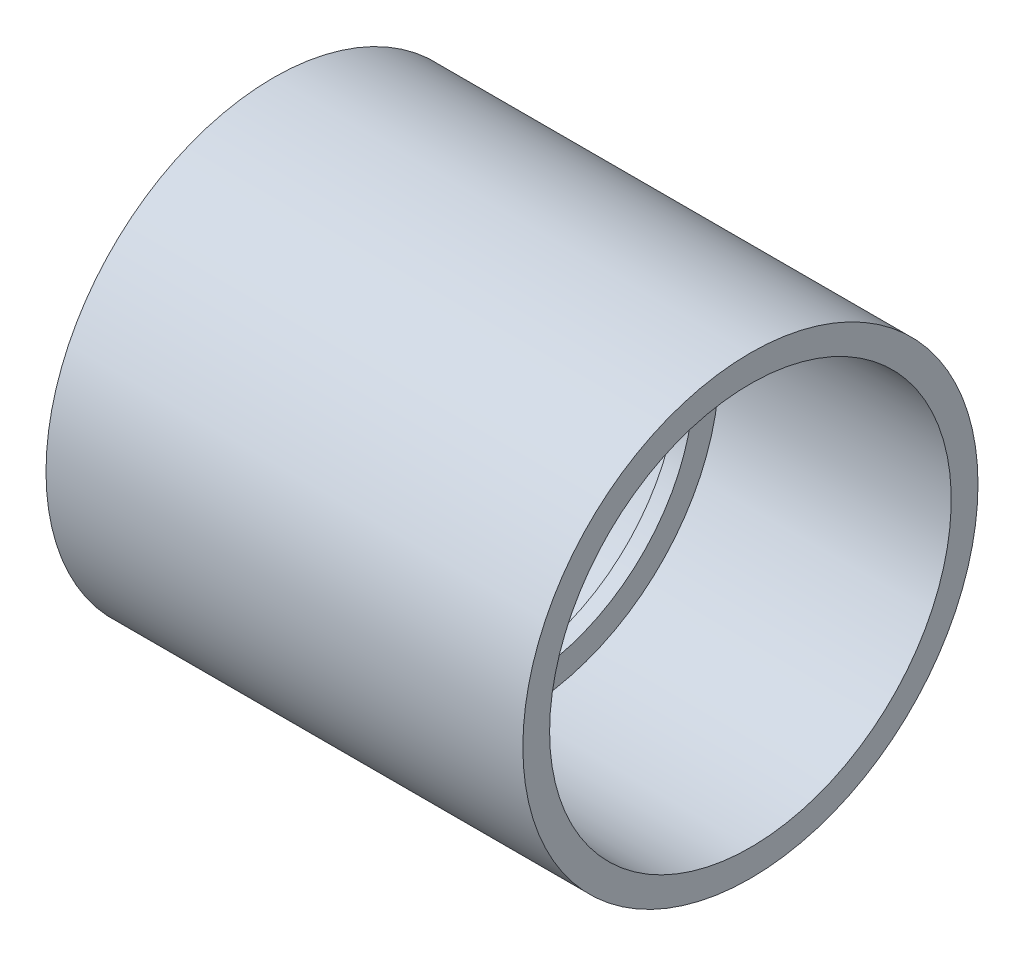
ISO-10303-21;
HEADER;
FILE_DESCRIPTION(('STEP AP214'),'2;1');
FILE_NAME('part.step','',(''),(''),'','','');
FILE_SCHEMA(('AUTOMOTIVE_DESIGN { 1 0 10303 214 1 1 1 1 }'));
ENDSEC;
DATA;
#1=APPLICATION_CONTEXT('core data for automotive mechanical design processes');
#2=APPLICATION_PROTOCOL_DEFINITION('international standard','automotive_design',2000,#1);
#3=PRODUCT_CONTEXT('',#1,'mechanical');
#4=PRODUCT('Part','Part','',(#3));
#5=PRODUCT_RELATED_PRODUCT_CATEGORY('part','',(#4));
#6=PRODUCT_DEFINITION_FORMATION('','',#4);
#7=PRODUCT_DEFINITION_CONTEXT('part definition',#1,'design');
#8=PRODUCT_DEFINITION('design','',#6,#7);
#9=PRODUCT_DEFINITION_SHAPE('','',#8);
#10=(LENGTH_UNIT() NAMED_UNIT(*) SI_UNIT(.MILLI.,.METRE.));
#11=(NAMED_UNIT(*) PLANE_ANGLE_UNIT() SI_UNIT($,.RADIAN.));
#12=(NAMED_UNIT(*) SI_UNIT($,.STERADIAN.) SOLID_ANGLE_UNIT());
#13=UNCERTAINTY_MEASURE_WITH_UNIT(LENGTH_MEASURE(1.E-05),#10,'distance_accuracy_value','');
#14=(GEOMETRIC_REPRESENTATION_CONTEXT(3) GLOBAL_UNCERTAINTY_ASSIGNED_CONTEXT((#13)) GLOBAL_UNIT_ASSIGNED_CONTEXT((#10,
#11,#12)) REPRESENTATION_CONTEXT('',''));
#15=CARTESIAN_POINT('',(0.,0.,0.));
#16=DIRECTION('',(0.,0.,1.));
#17=DIRECTION('',(1.,0.,0.));
#18=AXIS2_PLACEMENT_3D('',#15,#16,#17);
#19=CARTESIAN_POINT('',(-35.9918,0.,0.));
#20=DIRECTION('',(-1.,0.,0.));
#21=DIRECTION('',(0.,0.,1.));
#22=AXIS2_PLACEMENT_3D('',#19,#20,#21);
#23=CYLINDRICAL_SURFACE('',#22,34.3535);
#24=CARTESIAN_POINT('',(35.9918,0.,0.));
#25=DIRECTION('',(-1.,0.,0.));
#26=DIRECTION('',(0.,0.,1.));
#27=AXIS2_PLACEMENT_3D('',#24,#25,#26);
#28=CIRCLE('',#27,34.3535);
#29=CARTESIAN_POINT('',(35.9918,0.,34.3535));
#30=VERTEX_POINT('',#29);
#31=EDGE_CURVE('E58',#30,#30,#28,.T.);
#32=ORIENTED_EDGE('',*,*,#31,.T.);
#33=EDGE_LOOP('',(#32));
#34=FACE_BOUND('',#33,.T.);
#35=CARTESIAN_POINT('',(-35.9918,0.,0.));
#36=DIRECTION('',(-1.,0.,0.));
#37=DIRECTION('',(0.,0.,1.));
#38=AXIS2_PLACEMENT_3D('',#35,#36,#37);
#39=CIRCLE('',#38,34.3535);
#40=CARTESIAN_POINT('',(-35.9918,0.,34.3535));
#41=VERTEX_POINT('',#40);
#42=EDGE_CURVE('E10',#41,#41,#39,.T.);
#43=ORIENTED_EDGE('',*,*,#42,.F.);
#44=EDGE_LOOP('',(#43));
#45=FACE_BOUND('',#44,.T.);
#46=ADVANCED_FACE('F30',(#34,#45),#23,.T.);
#47=CARTESIAN_POINT('',(-35.9918,-34.3535,0.));
#48=DIRECTION('',(-1.,0.,0.));
#49=DIRECTION('',(0.,0.,1.));
#50=AXIS2_PLACEMENT_3D('',#47,#48,#49);
#51=PLANE('',#50);
#52=ORIENTED_EDGE('',*,*,#42,.T.);
#53=EDGE_LOOP('',(#52));
#54=FACE_BOUND('',#53,.T.);
#55=CARTESIAN_POINT('',(-35.9918,0.,0.));
#56=DIRECTION('',(-1.,0.,0.));
#57=DIRECTION('',(0.,0.,1.));
#58=AXIS2_PLACEMENT_3D('',#55,#56,#57);
#59=CIRCLE('',#58,30.3149);
#60=CARTESIAN_POINT('',(-35.9918,0.,30.3149));
#61=VERTEX_POINT('',#60);
#62=EDGE_CURVE('E36',#61,#61,#59,.T.);
#63=ORIENTED_EDGE('',*,*,#62,.F.);
#64=EDGE_LOOP('',(#63));
#65=FACE_BOUND('',#64,.T.);
#66=ADVANCED_FACE('F76',(#54,#65),#51,.T.);
#67=CARTESIAN_POINT('',(-1.19379999999999,0.,0.));
#68=DIRECTION('',(-1.,0.,0.));
#69=DIRECTION('',(0.,0.,1.));
#70=AXIS2_PLACEMENT_3D('',#67,#68,#69);
#71=CONICAL_SURFACE('',#70,30.0863,0.00656924856536293);
#72=ORIENTED_EDGE('',*,*,#62,.T.);
#73=EDGE_LOOP('',(#72));
#74=FACE_BOUND('',#73,.T.);
#75=CARTESIAN_POINT('',(-1.19379999999999,0.,0.));
#76=DIRECTION('',(-1.,0.,0.));
#77=DIRECTION('',(0.,0.,1.));
#78=AXIS2_PLACEMENT_3D('',#75,#76,#77);
#79=CIRCLE('',#78,30.0863);
#80=CARTESIAN_POINT('',(-1.19379999999999,0.,30.0863));
#81=VERTEX_POINT('',#80);
#82=EDGE_CURVE('E40',#81,#81,#79,.T.);
#83=ORIENTED_EDGE('',*,*,#82,.F.);
#84=EDGE_LOOP('',(#83));
#85=FACE_BOUND('',#84,.T.);
#86=ADVANCED_FACE('F80',(#74,#85),#71,.F.);
#87=CARTESIAN_POINT('',(-1.19379999999999,-30.0863,0.));
#88=DIRECTION('',(-1.,0.,0.));
#89=DIRECTION('',(0.,0.,1.));
#90=AXIS2_PLACEMENT_3D('',#87,#88,#89);
#91=PLANE('',#90);
#92=ORIENTED_EDGE('',*,*,#82,.T.);
#93=EDGE_LOOP('',(#92));
#94=FACE_BOUND('',#93,.T.);
#95=CARTESIAN_POINT('',(-1.19379999999999,0.,0.));
#96=DIRECTION('',(-1.,0.,0.));
#97=DIRECTION('',(0.,0.,1.));
#98=AXIS2_PLACEMENT_3D('',#95,#96,#97);
#99=CIRCLE('',#98,26.2509);
#100=CARTESIAN_POINT('',(-1.19379999999999,0.,26.2509));
#101=VERTEX_POINT('',#100);
#102=EDGE_CURVE('E44',#101,#101,#99,.T.);
#103=ORIENTED_EDGE('',*,*,#102,.F.);
#104=EDGE_LOOP('',(#103));
#105=FACE_BOUND('',#104,.T.);
#106=ADVANCED_FACE('F84',(#94,#105),#91,.T.);
#107=CARTESIAN_POINT('',(-35.9918,0.,0.));
#108=DIRECTION('',(-1.,0.,0.));
#109=DIRECTION('',(0.,0.,1.));
#110=AXIS2_PLACEMENT_3D('',#107,#108,#109);
#111=CYLINDRICAL_SURFACE('',#110,26.2509);
#112=ORIENTED_EDGE('',*,*,#102,.T.);
#113=EDGE_LOOP('',(#112));
#114=FACE_BOUND('',#113,.T.);
#115=CARTESIAN_POINT('',(1.1938,0.,0.));
#116=DIRECTION('',(-1.,0.,0.));
#117=DIRECTION('',(0.,0.,1.));
#118=AXIS2_PLACEMENT_3D('',#115,#116,#117);
#119=CIRCLE('',#118,26.2509);
#120=CARTESIAN_POINT('',(1.1938,0.,26.2509));
#121=VERTEX_POINT('',#120);
#122=EDGE_CURVE('E49',#121,#121,#119,.T.);
#123=ORIENTED_EDGE('',*,*,#122,.F.);
#124=EDGE_LOOP('',(#123));
#125=FACE_BOUND('',#124,.T.);
#126=ADVANCED_FACE('F90',(#114,#125),#111,.F.);
#127=CARTESIAN_POINT('',(1.1938,-30.0863,0.));
#128=DIRECTION('',(1.,0.,0.));
#129=DIRECTION('',(0.,0.,-1.));
#130=AXIS2_PLACEMENT_3D('',#127,#128,#129);
#131=PLANE('',#130);
#132=ORIENTED_EDGE('',*,*,#122,.T.);
#133=EDGE_LOOP('',(#132));
#134=FACE_BOUND('',#133,.T.);
#135=CARTESIAN_POINT('',(1.1938,0.,0.));
#136=DIRECTION('',(-1.,0.,0.));
#137=DIRECTION('',(0.,0.,1.));
#138=AXIS2_PLACEMENT_3D('',#135,#136,#137);
#139=CIRCLE('',#138,30.0863);
#140=CARTESIAN_POINT('',(1.1938,0.,30.0863));
#141=VERTEX_POINT('',#140);
#142=EDGE_CURVE('E52',#141,#141,#139,.T.);
#143=ORIENTED_EDGE('',*,*,#142,.F.);
#144=EDGE_LOOP('',(#143));
#145=FACE_BOUND('',#144,.T.);
#146=ADVANCED_FACE('F72',(#134,#145),#131,.T.);
#147=CARTESIAN_POINT('',(35.9918,0.,0.));
#148=DIRECTION('',(1.,0.,0.));
#149=DIRECTION('',(0.,0.,-1.));
#150=AXIS2_PLACEMENT_3D('',#147,#148,#149);
#151=CONICAL_SURFACE('',#150,30.3149,0.00656924856536263);
#152=ORIENTED_EDGE('',*,*,#142,.T.);
#153=EDGE_LOOP('',(#152));
#154=FACE_BOUND('',#153,.T.);
#155=CARTESIAN_POINT('',(35.9918,0.,0.));
#156=DIRECTION('',(-1.,0.,0.));
#157=DIRECTION('',(0.,0.,1.));
#158=AXIS2_PLACEMENT_3D('',#155,#156,#157);
#159=CIRCLE('',#158,30.3149);
#160=CARTESIAN_POINT('',(35.9918,0.,30.3149));
#161=VERTEX_POINT('',#160);
#162=EDGE_CURVE('E55',#161,#161,#159,.T.);
#163=ORIENTED_EDGE('',*,*,#162,.F.);
#164=EDGE_LOOP('',(#163));
#165=FACE_BOUND('',#164,.T.);
#166=ADVANCED_FACE('F66',(#154,#165),#151,.F.);
#167=CARTESIAN_POINT('',(35.9918,-34.3535,0.));
#168=DIRECTION('',(1.,0.,0.));
#169=DIRECTION('',(0.,0.,-1.));
#170=AXIS2_PLACEMENT_3D('',#167,#168,#169);
#171=PLANE('',#170);
#172=ORIENTED_EDGE('',*,*,#162,.T.);
#173=EDGE_LOOP('',(#172));
#174=FACE_BOUND('',#173,.T.);
#175=ORIENTED_EDGE('',*,*,#31,.F.);
#176=EDGE_LOOP('',(#175));
#177=FACE_BOUND('',#176,.T.);
#178=ADVANCED_FACE('F64',(#174,#177),#171,.T.);
#179=CLOSED_SHELL('',(#46,#66,#86,#106,#126,#146,#166,#178));
#180=MANIFOLD_SOLID_BREP('B2',#179);
#181=ADVANCED_BREP_SHAPE_REPRESENTATION('',(#18,#180),#14);
#182=SHAPE_DEFINITION_REPRESENTATION(#9,#181);
ENDSEC;
END-ISO-10303-21;
